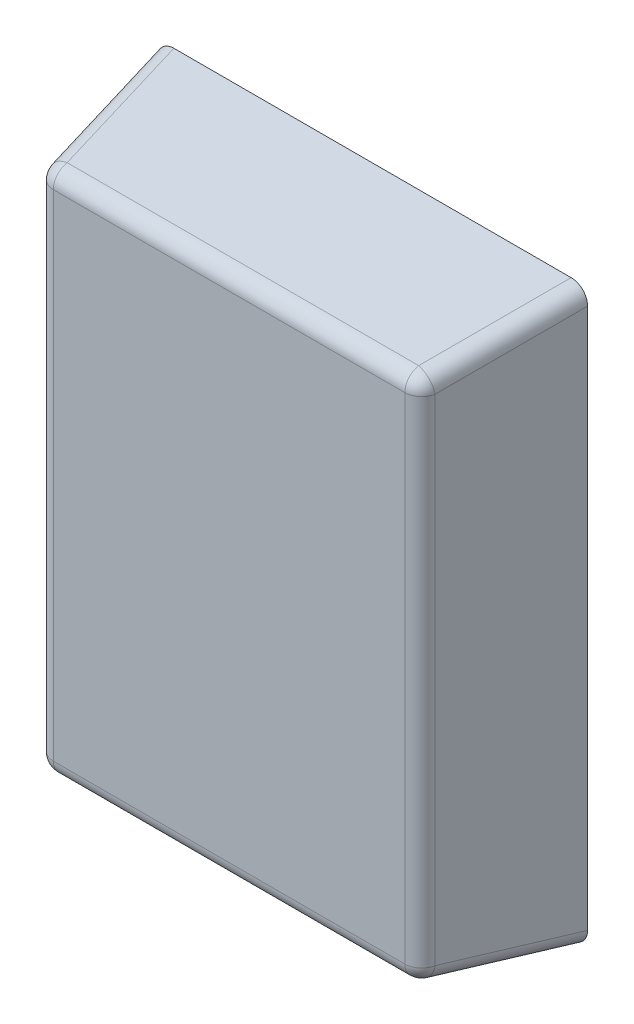
ISO-10303-21;
HEADER;
FILE_DESCRIPTION(('STEP AP214'),'2;1');
FILE_NAME('part.step','',(''),(''),'','','');
FILE_SCHEMA(('AUTOMOTIVE_DESIGN { 1 0 10303 214 1 1 1 1 }'));
ENDSEC;
DATA;
#1=APPLICATION_CONTEXT('core data for automotive mechanical design processes');
#2=APPLICATION_PROTOCOL_DEFINITION('international standard','automotive_design',2000,#1);
#3=PRODUCT_CONTEXT('',#1,'mechanical');
#4=PRODUCT('Part','Part','',(#3));
#5=PRODUCT_RELATED_PRODUCT_CATEGORY('part','',(#4));
#6=PRODUCT_DEFINITION_FORMATION('','',#4);
#7=PRODUCT_DEFINITION_CONTEXT('part definition',#1,'design');
#8=PRODUCT_DEFINITION('design','',#6,#7);
#9=PRODUCT_DEFINITION_SHAPE('','',#8);
#10=(LENGTH_UNIT() NAMED_UNIT(*) SI_UNIT(.MILLI.,.METRE.));
#11=(NAMED_UNIT(*) PLANE_ANGLE_UNIT() SI_UNIT($,.RADIAN.));
#12=(NAMED_UNIT(*) SI_UNIT($,.STERADIAN.) SOLID_ANGLE_UNIT());
#13=UNCERTAINTY_MEASURE_WITH_UNIT(LENGTH_MEASURE(1.E-05),#10,'distance_accuracy_value','');
#14=(GEOMETRIC_REPRESENTATION_CONTEXT(3) GLOBAL_UNCERTAINTY_ASSIGNED_CONTEXT((#13)) GLOBAL_UNIT_ASSIGNED_CONTEXT((#10,
#11,#12)) REPRESENTATION_CONTEXT('',''));
#15=CARTESIAN_POINT('',(0.,0.,0.));
#16=DIRECTION('',(0.,0.,1.));
#17=DIRECTION('',(1.,0.,0.));
#18=AXIS2_PLACEMENT_3D('',#15,#16,#17);
#19=CARTESIAN_POINT('',(0.464535714690618,-0.641019643054923,0.245));
#20=DIRECTION('',(0.,0.,1.));
#21=DIRECTION('',(1.,0.,0.));
#22=AXIS2_PLACEMENT_3D('',#19,#20,#21);
#23=PLANE('',#22);
#24=DIRECTION('',(0.,1.,0.));
#25=VECTOR('',#24,1.);
#26=CARTESIAN_POINT('',(0.538082398429869,-0.581022128259369,0.245));
#27=LINE('',#26,#25);
#28=CARTESIAN_POINT('',(0.538082398429869,-0.537477929724562,0.245));
#29=VERTEX_POINT('',#28);
#30=CARTESIAN_POINT('',(0.538082398429869,-0.744561356385284,0.245));
#31=VERTEX_POINT('',#30);
#32=EDGE_CURVE('E134',#29,#31,#27,.F.);
#33=ORIENTED_EDGE('',*,*,#32,.F.);
#34=DIRECTION('',(-1.,0.,0.));
#35=VECTOR('',#34,1.);
#36=CARTESIAN_POINT('',(0.419535714690618,-0.537477929724562,0.245));
#37=LINE('',#36,#35);
#38=CARTESIAN_POINT('',(0.390989030951366,-0.537477929724562,0.245));
#39=VERTEX_POINT('',#38);
#40=EDGE_CURVE('E237',#39,#29,#37,.F.);
#41=ORIENTED_EDGE('',*,*,#40,.F.);
#42=DIRECTION('',(0.,-1.,0.));
#43=VECTOR('',#42,1.);
#44=CARTESIAN_POINT('',(0.390989030951366,-0.701017157850478,0.245));
#45=LINE('',#44,#43);
#46=CARTESIAN_POINT('',(0.390989030951366,-0.744561356385284,0.245));
#47=VERTEX_POINT('',#46);
#48=EDGE_CURVE('E140',#47,#39,#45,.F.);
#49=ORIENTED_EDGE('',*,*,#48,.F.);
#50=DIRECTION('',(1.,0.,0.));
#51=VECTOR('',#50,1.);
#52=CARTESIAN_POINT('',(0.509535714690618,-0.744561356385284,0.245));
#53=LINE('',#52,#51);
#54=EDGE_CURVE('E114',#31,#47,#53,.F.);
#55=ORIENTED_EDGE('',*,*,#54,.F.);
#56=EDGE_LOOP('',(#33,#41,#49,#55));
#57=FACE_BOUND('',#56,.T.);
#58=ADVANCED_FACE('F17',(#57),#23,.T.);
#59=CARTESIAN_POINT('',(0.390989030951366,-0.701017157850478,0.238));
#60=DIRECTION('',(0.,-1.,0.));
#61=DIRECTION('',(1.,0.,0.));
#62=AXIS2_PLACEMENT_3D('',#59,#60,#61);
#63=CYLINDRICAL_SURFACE('',#62,0.007);
#64=DIRECTION('',(0.,1.,0.));
#65=VECTOR('',#64,1.);
#66=CARTESIAN_POINT('',(0.38409537668028,-0.761014672646032,0.239215537243668));
#67=LINE('',#66,#65);
#68=CARTESIAN_POINT('',(0.38409537668028,-0.744561356385283,0.239215537243668));
#69=VERTEX_POINT('',#68);
#70=CARTESIAN_POINT('',(0.384095376680281,-0.537477929724562,0.239215537243668));
#71=VERTEX_POINT('',#70);
#72=EDGE_CURVE('E183',#69,#71,#67,.T.);
#73=ORIENTED_EDGE('',*,*,#72,.F.);
#74=CARTESIAN_POINT('',(0.390989030951365,-0.744561356385283,0.238));
#75=DIRECTION('',(0.,-1.,-1.82015343698568E-13));
#76=DIRECTION('',(1.,0.,0.));
#77=AXIS2_PLACEMENT_3D('',#74,#75,#76);
#78=CIRCLE('',#77,0.007);
#79=EDGE_CURVE('E103',#47,#69,#78,.T.);
#80=ORIENTED_EDGE('',*,*,#79,.F.);
#81=ORIENTED_EDGE('',*,*,#48,.T.);
#82=CARTESIAN_POINT('',(0.390989030951366,-0.537477929724562,0.238));
#83=DIRECTION('',(0.,-1.,0.));
#84=DIRECTION('',(1.,0.,0.));
#85=AXIS2_PLACEMENT_3D('',#82,#83,#84);
#86=CIRCLE('',#85,0.007);
#87=EDGE_CURVE('E90',#71,#39,#86,.F.);
#88=ORIENTED_EDGE('',*,*,#87,.F.);
#89=EDGE_LOOP('',(#73,#80,#81,#88));
#90=FACE_BOUND('',#89,.T.);
#91=ADVANCED_FACE('F229',(#90),#63,.T.);
#92=CARTESIAN_POINT('',(0.390989030951365,-0.744561356385283,0.238));
#93=DIRECTION('',(1.,0.,0.));
#94=DIRECTION('',(0.,1.,0.));
#95=AXIS2_PLACEMENT_3D('',#92,#93,#94);
#96=SPHERICAL_SURFACE('',#95,0.007);
#97=ORIENTED_EDGE('',*,*,#79,.T.);
#98=CARTESIAN_POINT('',(0.390989030951366,-0.744561356385283,0.237999999999999));
#99=DIRECTION('',(-0.171087869746035,-0.171087869746037,-0.970287525247814));
#100=DIRECTION('',(0.,0.984807753012208,-0.173648177666932));
#101=AXIS2_PLACEMENT_3D('',#98,#99,#100);
#102=CIRCLE('',#101,0.007);
#103=CARTESIAN_POINT('',(0.390989030951366,-0.751455010656369,0.239215537243668));
#104=VERTEX_POINT('',#103);
#105=EDGE_CURVE('E20',#104,#69,#102,.T.);
#106=ORIENTED_EDGE('',*,*,#105,.F.);
#107=CARTESIAN_POINT('',(0.390989030951366,-0.744561356385284,0.238));
#108=DIRECTION('',(1.,0.,0.));
#109=DIRECTION('',(0.,1.,0.));
#110=AXIS2_PLACEMENT_3D('',#107,#108,#109);
#111=CIRCLE('',#110,0.007);
#112=EDGE_CURVE('E122',#47,#104,#111,.T.);
#113=ORIENTED_EDGE('',*,*,#112,.F.);
#114=EDGE_LOOP('',(#97,#106,#113));
#115=FACE_BOUND('',#114,.T.);
#116=ADVANCED_FACE('F226',(#115),#96,.T.);
#117=CARTESIAN_POINT('',(0.509535714690618,-0.744561356385284,0.238));
#118=DIRECTION('',(1.,0.,0.));
#119=DIRECTION('',(0.,1.,0.));
#120=AXIS2_PLACEMENT_3D('',#117,#118,#119);
#121=CYLINDRICAL_SURFACE('',#120,0.007);
#122=DIRECTION('',(1.,0.,0.));
#123=VECTOR('',#122,1.);
#124=CARTESIAN_POINT('',(0.554535714690617,-0.75145501065637,0.239215537243668));
#125=LINE('',#124,#123);
#126=CARTESIAN_POINT('',(0.538082398429869,-0.751455010656369,0.239215537243668));
#127=VERTEX_POINT('',#126);
#128=EDGE_CURVE('E117',#127,#104,#125,.F.);
#129=ORIENTED_EDGE('',*,*,#128,.F.);
#130=CARTESIAN_POINT('',(0.538082398429869,-0.744561356385284,0.238));
#131=DIRECTION('',(1.,0.,0.));
#132=DIRECTION('',(0.,1.,0.));
#133=AXIS2_PLACEMENT_3D('',#130,#131,#132);
#134=CIRCLE('',#133,0.00699999999999995);
#135=EDGE_CURVE('E110',#31,#127,#134,.T.);
#136=ORIENTED_EDGE('',*,*,#135,.F.);
#137=ORIENTED_EDGE('',*,*,#54,.T.);
#138=ORIENTED_EDGE('',*,*,#112,.T.);
#139=EDGE_LOOP('',(#129,#136,#137,#138));
#140=FACE_BOUND('',#139,.T.);
#141=ADVANCED_FACE('F112',(#140),#121,.T.);
#142=CARTESIAN_POINT('',(0.538082398429868,-0.744561356385284,0.238));
#143=DIRECTION('',(1.,0.,0.));
#144=DIRECTION('',(0.,1.,0.));
#145=AXIS2_PLACEMENT_3D('',#142,#143,#144);
#146=SPHERICAL_SURFACE('',#145,0.007);
#147=ORIENTED_EDGE('',*,*,#135,.T.);
#148=CARTESIAN_POINT('',(0.538082398429868,-0.744561356385283,0.237999999999999));
#149=DIRECTION('',(0.171087869746039,-0.171087869746042,-0.970287525247812));
#150=DIRECTION('',(0.,0.984807753012207,-0.173648177666937));
#151=AXIS2_PLACEMENT_3D('',#148,#149,#150);
#152=CIRCLE('',#151,0.007);
#153=CARTESIAN_POINT('',(0.544976052700954,-0.744561356385284,0.239215537243668));
#154=VERTEX_POINT('',#153);
#155=EDGE_CURVE('E126',#154,#127,#152,.T.);
#156=ORIENTED_EDGE('',*,*,#155,.F.);
#157=CARTESIAN_POINT('',(0.538082398429869,-0.744561356385284,0.238));
#158=DIRECTION('',(0.,1.,0.));
#159=DIRECTION('',(-1.,0.,0.));
#160=AXIS2_PLACEMENT_3D('',#157,#158,#159);
#161=CIRCLE('',#160,0.007);
#162=EDGE_CURVE('E121',#31,#154,#161,.T.);
#163=ORIENTED_EDGE('',*,*,#162,.F.);
#164=EDGE_LOOP('',(#147,#156,#163));
#165=FACE_BOUND('',#164,.T.);
#166=ADVANCED_FACE('F125',(#165),#146,.T.);
#167=CARTESIAN_POINT('',(0.538082398429869,-0.581022128259369,0.238));
#168=DIRECTION('',(0.,1.,0.));
#169=DIRECTION('',(-1.,0.,0.));
#170=AXIS2_PLACEMENT_3D('',#167,#168,#169);
#171=CYLINDRICAL_SURFACE('',#170,0.007);
#172=DIRECTION('',(0.,1.,0.));
#173=VECTOR('',#172,1.);
#174=CARTESIAN_POINT('',(0.544976052700955,-0.521024613463814,0.239215537243668));
#175=LINE('',#174,#173);
#176=CARTESIAN_POINT('',(0.544976052700955,-0.537477929724562,0.239215537243668));
#177=VERTEX_POINT('',#176);
#178=EDGE_CURVE('E165',#177,#154,#175,.F.);
#179=ORIENTED_EDGE('',*,*,#178,.F.);
#180=CARTESIAN_POINT('',(0.538082398429869,-0.537477929724562,0.238));
#181=DIRECTION('',(0.,-1.,0.));
#182=DIRECTION('',(1.,0.,0.));
#183=AXIS2_PLACEMENT_3D('',#180,#181,#182);
#184=CIRCLE('',#183,0.007);
#185=EDGE_CURVE('E131',#29,#177,#184,.F.);
#186=ORIENTED_EDGE('',*,*,#185,.F.);
#187=ORIENTED_EDGE('',*,*,#32,.T.);
#188=ORIENTED_EDGE('',*,*,#162,.T.);
#189=EDGE_LOOP('',(#179,#186,#187,#188));
#190=FACE_BOUND('',#189,.T.);
#191=ADVANCED_FACE('F135',(#190),#171,.T.);
#192=CARTESIAN_POINT('',(0.538082398429869,-0.537477929724562,0.238));
#193=DIRECTION('',(1.,0.,0.));
#194=DIRECTION('',(0.,1.,0.));
#195=AXIS2_PLACEMENT_3D('',#192,#193,#194);
#196=SPHERICAL_SURFACE('',#195,0.007);
#197=CARTESIAN_POINT('',(0.538082398429869,-0.537477929724562,0.238));
#198=DIRECTION('',(-1.,0.,0.));
#199=DIRECTION('',(0.,-1.,0.));
#200=AXIS2_PLACEMENT_3D('',#197,#198,#199);
#201=CIRCLE('',#200,0.007);
#202=CARTESIAN_POINT('',(0.538082398429869,-0.530584275453477,0.239215537243668));
#203=VERTEX_POINT('',#202);
#204=EDGE_CURVE('E216',#29,#203,#201,.T.);
#205=ORIENTED_EDGE('',*,*,#204,.F.);
#206=ORIENTED_EDGE('',*,*,#185,.T.);
#207=CARTESIAN_POINT('',(0.538082398429869,-0.537477929724563,0.237999999999999));
#208=DIRECTION('',(0.17108786974604,0.171087869746041,-0.970287525247812));
#209=DIRECTION('',(0.,0.984807753012207,0.173648177666936));
#210=AXIS2_PLACEMENT_3D('',#207,#208,#209);
#211=CIRCLE('',#210,0.007);
#212=EDGE_CURVE('E162',#203,#177,#211,.T.);
#213=ORIENTED_EDGE('',*,*,#212,.F.);
#214=EDGE_LOOP('',(#205,#206,#213));
#215=FACE_BOUND('',#214,.T.);
#216=ADVANCED_FACE('F204',(#215),#196,.T.);
#217=CARTESIAN_POINT('',(0.419535714690618,-0.537477929724562,0.238));
#218=DIRECTION('',(-1.,0.,0.));
#219=DIRECTION('',(0.,-1.,0.));
#220=AXIS2_PLACEMENT_3D('',#217,#218,#219);
#221=CYLINDRICAL_SURFACE('',#220,0.007);
#222=DIRECTION('',(1.,0.,0.));
#223=VECTOR('',#222,1.);
#224=CARTESIAN_POINT('',(0.374535714690617,-0.530584275453476,0.239215537243668));
#225=LINE('',#224,#223);
#226=CARTESIAN_POINT('',(0.390989030951366,-0.530584275453477,0.239215537243668));
#227=VERTEX_POINT('',#226);
#228=EDGE_CURVE('E163',#227,#203,#225,.T.);
#229=ORIENTED_EDGE('',*,*,#228,.F.);
#230=CARTESIAN_POINT('',(0.390989030951366,-0.537477929724562,0.238));
#231=DIRECTION('',(1.,0.,0.));
#232=DIRECTION('',(0.,1.,0.));
#233=AXIS2_PLACEMENT_3D('',#230,#231,#232);
#234=CIRCLE('',#233,0.00699999999999995);
#235=EDGE_CURVE('E98',#39,#227,#234,.F.);
#236=ORIENTED_EDGE('',*,*,#235,.F.);
#237=ORIENTED_EDGE('',*,*,#40,.T.);
#238=ORIENTED_EDGE('',*,*,#204,.T.);
#239=EDGE_LOOP('',(#229,#236,#237,#238));
#240=FACE_BOUND('',#239,.T.);
#241=ADVANCED_FACE('F199',(#240),#221,.T.);
#242=CARTESIAN_POINT('',(0.390989030951366,-0.537477929724562,0.238));
#243=DIRECTION('',(1.,0.,0.));
#244=DIRECTION('',(0.,1.,0.));
#245=AXIS2_PLACEMENT_3D('',#242,#243,#244);
#246=SPHERICAL_SURFACE('',#245,0.007);
#247=ORIENTED_EDGE('',*,*,#87,.T.);
#248=ORIENTED_EDGE('',*,*,#235,.T.);
#249=CARTESIAN_POINT('',(0.390989030951366,-0.537477929724562,0.237999999999999));
#250=DIRECTION('',(-0.171087869746029,0.171087869746031,-0.970287525247816));
#251=DIRECTION('',(0.,0.984807753012209,0.173648177666926));
#252=AXIS2_PLACEMENT_3D('',#249,#250,#251);
#253=CIRCLE('',#252,0.007);
#254=EDGE_CURVE('E158',#71,#227,#253,.T.);
#255=ORIENTED_EDGE('',*,*,#254,.F.);
#256=EDGE_LOOP('',(#247,#248,#255));
#257=FACE_BOUND('',#256,.T.);
#258=ADVANCED_FACE('F194',(#257),#246,.T.);
#259=CARTESIAN_POINT('',(0.374535714690617,-0.761014672646032,0.185));
#260=DIRECTION('',(-0.984807753012208,0.,0.173648177666928));
#261=DIRECTION('',(0.173648177666928,0.,0.984807753012208));
#262=AXIS2_PLACEMENT_3D('',#259,#260,#261);
#263=PLANE('',#262);
#264=DIRECTION('',(-0.171087869746035,-0.171087869746037,-0.970287525247814));
#265=VECTOR('',#264,1.);
#266=CARTESIAN_POINT('',(0.376968325454203,-0.751688407611361,0.198796021197729));
#267=LINE('',#266,#265);
#268=CARTESIAN_POINT('',(0.374535714690617,-0.754121018374946,0.185));
#269=VERTEX_POINT('',#268);
#270=EDGE_CURVE('E181',#69,#269,#267,.T.);
#271=ORIENTED_EDGE('',*,*,#270,.F.);
#272=ORIENTED_EDGE('',*,*,#72,.T.);
#273=DIRECTION('',(-0.171087869746032,0.171087869746027,-0.970287525247816));
#274=VECTOR('',#273,1.);
#275=CARTESIAN_POINT('',(0.384095376680281,-0.537477929724562,0.239215537243668));
#276=LINE('',#275,#274);
#277=CARTESIAN_POINT('',(0.374535714690618,-0.527918267734899,0.185));
#278=VERTEX_POINT('',#277);
#279=EDGE_CURVE('E186',#71,#278,#276,.T.);
#280=ORIENTED_EDGE('',*,*,#279,.T.);
#281=DIRECTION('',(0.,1.,0.));
#282=VECTOR('',#281,1.);
#283=CARTESIAN_POINT('',(0.374535714690617,-0.641019643054923,0.185));
#284=LINE('',#283,#282);
#285=EDGE_CURVE('E155',#278,#269,#284,.F.);
#286=ORIENTED_EDGE('',*,*,#285,.T.);
#287=EDGE_LOOP('',(#271,#272,#280,#286));
#288=FACE_BOUND('',#287,.T.);
#289=ADVANCED_FACE('F198',(#288),#263,.T.);
#290=CARTESIAN_POINT('',(0.383861979725288,-0.751688407611361,0.197580483954061));
#291=DIRECTION('',(-0.171087869746035,-0.171087869746037,-0.970287525247814));
#292=DIRECTION('',(0.,0.984807753012208,-0.173648177666932));
#293=AXIS2_PLACEMENT_3D('',#290,#291,#292);
#294=CYLINDRICAL_SURFACE('',#293,0.007);
#295=DIRECTION('',(-0.171087869746031,-0.171087869746037,-0.970287525247814));
#296=VECTOR('',#295,1.);
#297=CARTESIAN_POINT('',(0.390989030951365,-0.751455010656369,0.239215537243668));
#298=LINE('',#297,#296);
#299=CARTESIAN_POINT('',(0.381429368961702,-0.761014672646032,0.185));
#300=VERTEX_POINT('',#299);
#301=EDGE_CURVE('E172',#104,#300,#298,.T.);
#302=ORIENTED_EDGE('',*,*,#301,.F.);
#303=ORIENTED_EDGE('',*,*,#105,.T.);
#304=ORIENTED_EDGE('',*,*,#270,.T.);
#305=CARTESIAN_POINT('',(0.381643700973817,-0.753906686362832,0.185));
#306=DIRECTION('',(0.,0.,1.));
#307=DIRECTION('',(-0.707106781186543,-0.707106781186552,0.));
#308=AXIS2_PLACEMENT_3D('',#305,#306,#307);
#309=ELLIPSE('',#308,0.00721435638184896,0.007);
#310=EDGE_CURVE('E153',#269,#300,#309,.T.);
#311=ORIENTED_EDGE('',*,*,#310,.T.);
#312=EDGE_LOOP('',(#302,#303,#304,#311));
#313=FACE_BOUND('',#312,.T.);
#314=ADVANCED_FACE('F273',(#313),#294,.T.);
#315=CARTESIAN_POINT('',(0.554535714690617,-0.761014672646033,0.185));
#316=DIRECTION('',(0.,-0.984807753012208,0.173648177666931));
#317=DIRECTION('',(0.,-0.173648177666931,-0.984807753012208));
#318=AXIS2_PLACEMENT_3D('',#315,#316,#317);
#319=PLANE('',#318);
#320=DIRECTION('',(0.171087869746039,-0.171087869746042,-0.970287525247812));
#321=VECTOR('',#320,1.);
#322=CARTESIAN_POINT('',(0.544331463369852,-0.757704075596352,0.203775328859929));
#323=LINE('',#322,#321);
#324=CARTESIAN_POINT('',(0.547642060419532,-0.761014672646032,0.185));
#325=VERTEX_POINT('',#324);
#326=EDGE_CURVE('E166',#127,#325,#323,.T.);
#327=ORIENTED_EDGE('',*,*,#326,.F.);
#328=ORIENTED_EDGE('',*,*,#128,.T.);
#329=ORIENTED_EDGE('',*,*,#301,.T.);
#330=DIRECTION('',(1.,0.,0.));
#331=VECTOR('',#330,1.);
#332=CARTESIAN_POINT('',(0.464535714690618,-0.761014672646032,0.185));
#333=LINE('',#332,#331);
#334=EDGE_CURVE('E152',#300,#325,#333,.T.);
#335=ORIENTED_EDGE('',*,*,#334,.T.);
#336=EDGE_LOOP('',(#327,#328,#329,#335));
#337=FACE_BOUND('',#336,.T.);
#338=ADVANCED_FACE('F272',(#337),#319,.T.);
#339=CARTESIAN_POINT('',(0.544331463369852,-0.750810421325267,0.202559791616261));
#340=DIRECTION('',(0.171087869746039,-0.171087869746042,-0.970287525247812));
#341=DIRECTION('',(0.,0.984807753012207,-0.173648177666937));
#342=AXIS2_PLACEMENT_3D('',#339,#340,#341);
#343=CYLINDRICAL_SURFACE('',#342,0.007);
#344=DIRECTION('',(0.171087869746035,-0.171087869746032,-0.970287525247814));
#345=VECTOR('',#344,1.);
#346=CARTESIAN_POINT('',(0.544976052700954,-0.744561356385284,0.239215537243668));
#347=LINE('',#346,#345);
#348=CARTESIAN_POINT('',(0.554535714690617,-0.754121018374947,0.185));
#349=VERTEX_POINT('',#348);
#350=EDGE_CURVE('E168',#154,#349,#347,.T.);
#351=ORIENTED_EDGE('',*,*,#350,.F.);
#352=ORIENTED_EDGE('',*,*,#155,.T.);
#353=ORIENTED_EDGE('',*,*,#326,.T.);
#354=CARTESIAN_POINT('',(0.547427728407417,-0.753906686362832,0.185));
#355=DIRECTION('',(0.,0.,1.));
#356=DIRECTION('',(0.707106781186541,-0.707106781186554,0.));
#357=AXIS2_PLACEMENT_3D('',#354,#355,#356);
#358=ELLIPSE('',#357,0.00721435638184897,0.007);
#359=EDGE_CURVE('E150',#325,#349,#358,.T.);
#360=ORIENTED_EDGE('',*,*,#359,.T.);
#361=EDGE_LOOP('',(#351,#352,#353,#360));
#362=FACE_BOUND('',#361,.T.);
#363=ADVANCED_FACE('F293',(#362),#343,.T.);
#364=CARTESIAN_POINT('',(0.554535714690618,-0.521024613463814,0.185));
#365=DIRECTION('',(0.984807753012208,0.,0.173648177666929));
#366=DIRECTION('',(0.173648177666929,0.,-0.984807753012208));
#367=AXIS2_PLACEMENT_3D('',#364,#365,#366);
#368=PLANE('',#367);
#369=ORIENTED_EDGE('',*,*,#350,.T.);
#370=DIRECTION('',(0.,1.,0.));
#371=VECTOR('',#370,1.);
#372=CARTESIAN_POINT('',(0.554535714690617,-0.641019643054923,0.185));
#373=LINE('',#372,#371);
#374=CARTESIAN_POINT('',(0.554535714690618,-0.527918267734899,0.185));
#375=VERTEX_POINT('',#374);
#376=EDGE_CURVE('E149',#349,#375,#373,.T.);
#377=ORIENTED_EDGE('',*,*,#376,.T.);
#378=DIRECTION('',(0.17108786974604,0.171087869746041,-0.970287525247812));
#379=VECTOR('',#378,1.);
#380=CARTESIAN_POINT('',(0.552103103927032,-0.530350878498484,0.19879602119773));
#381=LINE('',#380,#379);
#382=EDGE_CURVE('E164',#177,#375,#381,.T.);
#383=ORIENTED_EDGE('',*,*,#382,.F.);
#384=ORIENTED_EDGE('',*,*,#178,.T.);
#385=EDGE_LOOP('',(#369,#377,#383,#384));
#386=FACE_BOUND('',#385,.T.);
#387=ADVANCED_FACE('F267',(#386),#368,.T.);
#388=CARTESIAN_POINT('',(0.545209449655947,-0.530350878498485,0.197580483954061));
#389=DIRECTION('',(0.17108786974604,0.171087869746041,-0.970287525247812));
#390=DIRECTION('',(0.,0.984807753012207,0.173648177666936));
#391=AXIS2_PLACEMENT_3D('',#388,#389,#390);
#392=CYLINDRICAL_SURFACE('',#391,0.007);
#393=DIRECTION('',(0.171087869746032,0.171087869746036,-0.970287525247815));
#394=VECTOR('',#393,1.);
#395=CARTESIAN_POINT('',(0.538082398429869,-0.530584275453476,0.239215537243668));
#396=LINE('',#395,#394);
#397=CARTESIAN_POINT('',(0.547642060419532,-0.521024613463814,0.185));
#398=VERTEX_POINT('',#397);
#399=EDGE_CURVE('E161',#203,#398,#396,.T.);
#400=ORIENTED_EDGE('',*,*,#399,.F.);
#401=ORIENTED_EDGE('',*,*,#212,.T.);
#402=ORIENTED_EDGE('',*,*,#382,.T.);
#403=CARTESIAN_POINT('',(0.547427728407418,-0.528132599747014,0.185));
#404=DIRECTION('',(0.,0.,1.));
#405=DIRECTION('',(0.707106781186545,0.70710678118655,0.));
#406=AXIS2_PLACEMENT_3D('',#403,#404,#405);
#407=ELLIPSE('',#406,0.00721435638184897,0.007);
#408=EDGE_CURVE('E26',#375,#398,#407,.T.);
#409=ORIENTED_EDGE('',*,*,#408,.T.);
#410=EDGE_LOOP('',(#400,#401,#402,#409));
#411=FACE_BOUND('',#410,.T.);
#412=ADVANCED_FACE('F257',(#411),#392,.T.);
#413=CARTESIAN_POINT('',(0.374535714690617,-0.521024613463813,0.185));
#414=DIRECTION('',(0.,0.984807753012208,0.17364817766693));
#415=DIRECTION('',(0.,-0.17364817766693,0.984807753012208));
#416=AXIS2_PLACEMENT_3D('',#413,#414,#415);
#417=PLANE('',#416);
#418=ORIENTED_EDGE('',*,*,#399,.T.);
#419=DIRECTION('',(1.,0.,0.));
#420=VECTOR('',#419,1.);
#421=CARTESIAN_POINT('',(0.464535714690618,-0.521024613463814,0.185));
#422=LINE('',#421,#420);
#423=CARTESIAN_POINT('',(0.381429368961703,-0.521024613463814,0.185));
#424=VERTEX_POINT('',#423);
#425=EDGE_CURVE('E11',#398,#424,#422,.F.);
#426=ORIENTED_EDGE('',*,*,#425,.T.);
#427=DIRECTION('',(-0.171087869746029,0.171087869746031,-0.970287525247816));
#428=VECTOR('',#427,1.);
#429=CARTESIAN_POINT('',(0.384739966011383,-0.524335210513494,0.203775328859929));
#430=LINE('',#429,#428);
#431=EDGE_CURVE('E157',#227,#424,#430,.T.);
#432=ORIENTED_EDGE('',*,*,#431,.F.);
#433=ORIENTED_EDGE('',*,*,#228,.T.);
#434=EDGE_LOOP('',(#418,#426,#432,#433));
#435=FACE_BOUND('',#434,.T.);
#436=ADVANCED_FACE('F254',(#435),#417,.T.);
#437=CARTESIAN_POINT('',(0.384739966011383,-0.531228864784579,0.202559791616261));
#438=DIRECTION('',(-0.171087869746029,0.171087869746031,-0.970287525247816));
#439=DIRECTION('',(0.,0.984807753012209,0.173648177666926));
#440=AXIS2_PLACEMENT_3D('',#437,#438,#439);
#441=CYLINDRICAL_SURFACE('',#440,0.007);
#442=ORIENTED_EDGE('',*,*,#431,.T.);
#443=CARTESIAN_POINT('',(0.381643700973818,-0.528132599747014,0.185));
#444=DIRECTION('',(0.,0.,1.));
#445=DIRECTION('',(-0.707106781186543,0.707106781186552,0.));
#446=AXIS2_PLACEMENT_3D('',#443,#444,#445);
#447=ELLIPSE('',#446,0.00721435638184894,0.007);
#448=EDGE_CURVE('E35',#424,#278,#447,.T.);
#449=ORIENTED_EDGE('',*,*,#448,.T.);
#450=ORIENTED_EDGE('',*,*,#279,.F.);
#451=ORIENTED_EDGE('',*,*,#254,.T.);
#452=EDGE_LOOP('',(#442,#449,#450,#451));
#453=FACE_BOUND('',#452,.T.);
#454=ADVANCED_FACE('F278',(#453),#441,.T.);
#455=CARTESIAN_POINT('',(0.464535714690618,-0.641019643054923,0.185));
#456=DIRECTION('',(0.,0.,1.));
#457=DIRECTION('',(1.,0.,0.));
#458=AXIS2_PLACEMENT_3D('',#455,#456,#457);
#459=PLANE('',#458);
#460=ORIENTED_EDGE('',*,*,#425,.F.);
#461=ORIENTED_EDGE('',*,*,#408,.F.);
#462=ORIENTED_EDGE('',*,*,#376,.F.);
#463=ORIENTED_EDGE('',*,*,#359,.F.);
#464=ORIENTED_EDGE('',*,*,#334,.F.);
#465=ORIENTED_EDGE('',*,*,#310,.F.);
#466=ORIENTED_EDGE('',*,*,#285,.F.);
#467=ORIENTED_EDGE('',*,*,#448,.F.);
#468=EDGE_LOOP('',(#460,#461,#462,#463,#464,#465,#466,#467));
#469=FACE_BOUND('',#468,.T.);
#470=ADVANCED_FACE('F268',(#469),#459,.F.);
#471=CLOSED_SHELL('',(#58,#91,#116,#141,#166,#191,#216,#241,#258,#289,#314,#338,#363,#387,#412,
#436,#454,#470));
#472=MANIFOLD_SOLID_BREP('B1',#471);
#473=ADVANCED_BREP_SHAPE_REPRESENTATION('',(#18,#472),#14);
#474=SHAPE_DEFINITION_REPRESENTATION(#9,#473);
ENDSEC;
END-ISO-10303-21;
